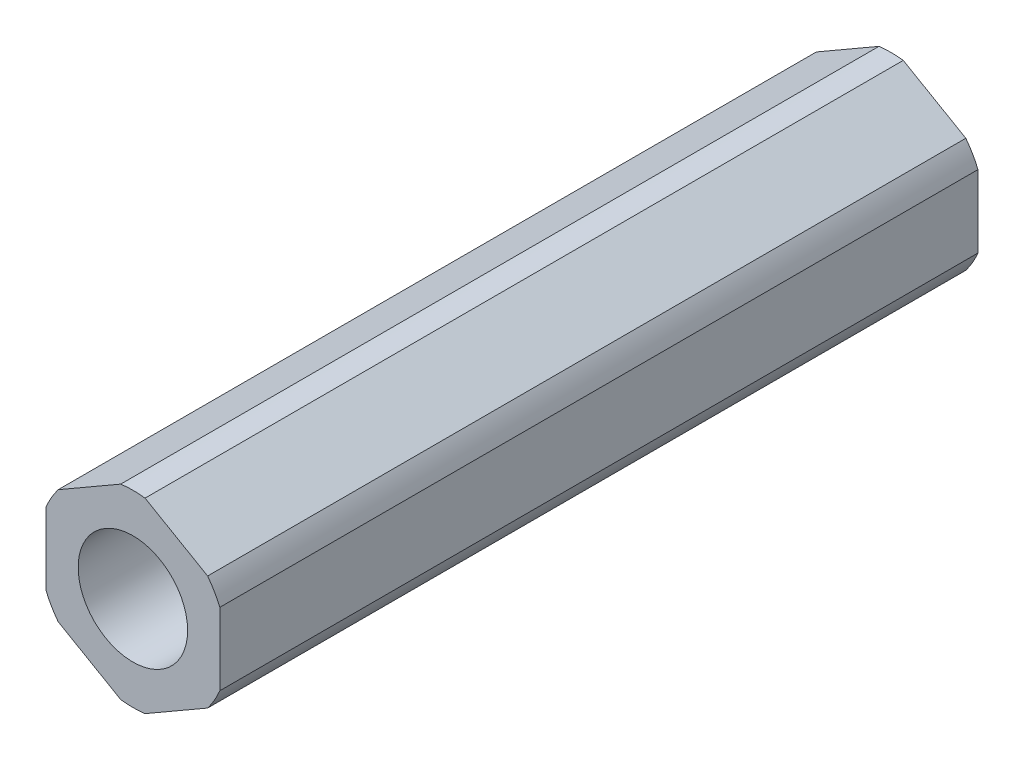
ISO-10303-21;
HEADER;
FILE_DESCRIPTION(('STEP AP214'),'2;1');
FILE_NAME('part.step','',(''),(''),'','','');
FILE_SCHEMA(('AUTOMOTIVE_DESIGN { 1 0 10303 214 1 1 1 1 }'));
ENDSEC;
DATA;
#1=APPLICATION_CONTEXT('core data for automotive mechanical design processes');
#2=APPLICATION_PROTOCOL_DEFINITION('international standard','automotive_design',2000,#1);
#3=PRODUCT_CONTEXT('',#1,'mechanical');
#4=PRODUCT('Part','Part','',(#3));
#5=PRODUCT_RELATED_PRODUCT_CATEGORY('part','',(#4));
#6=PRODUCT_DEFINITION_FORMATION('','',#4);
#7=PRODUCT_DEFINITION_CONTEXT('part definition',#1,'design');
#8=PRODUCT_DEFINITION('design','',#6,#7);
#9=PRODUCT_DEFINITION_SHAPE('','',#8);
#10=(LENGTH_UNIT() NAMED_UNIT(*) SI_UNIT(.MILLI.,.METRE.));
#11=(NAMED_UNIT(*) PLANE_ANGLE_UNIT() SI_UNIT($,.RADIAN.));
#12=(NAMED_UNIT(*) SI_UNIT($,.STERADIAN.) SOLID_ANGLE_UNIT());
#13=UNCERTAINTY_MEASURE_WITH_UNIT(LENGTH_MEASURE(1.E-05),#10,'distance_accuracy_value','');
#14=(GEOMETRIC_REPRESENTATION_CONTEXT(3) GLOBAL_UNCERTAINTY_ASSIGNED_CONTEXT((#13)) GLOBAL_UNIT_ASSIGNED_CONTEXT((#10,
#11,#12)) REPRESENTATION_CONTEXT('',''));
#15=CARTESIAN_POINT('',(0.,0.,0.));
#16=DIRECTION('',(0.,0.,1.));
#17=DIRECTION('',(1.,0.,0.));
#18=AXIS2_PLACEMENT_3D('',#15,#16,#17);
#19=CARTESIAN_POINT('',(0.,0.,27.70251));
#20=DIRECTION('',(0.,0.,1.));
#21=DIRECTION('',(1.,0.,0.));
#22=AXIS2_PLACEMENT_3D('',#19,#20,#21);
#23=PLANE('',#22);
#24=CARTESIAN_POINT('',(0.,0.,27.70251));
#25=DIRECTION('',(0.,0.,1.));
#26=DIRECTION('',(1.,0.,0.));
#27=AXIS2_PLACEMENT_3D('',#24,#25,#26);
#28=CIRCLE('',#27,4.);
#29=CARTESIAN_POINT('',(4.,0.,27.70251));
#30=VERTEX_POINT('',#29);
#31=EDGE_CURVE('E254',#30,#30,#28,.T.);
#32=ORIENTED_EDGE('',*,*,#31,.F.);
#33=EDGE_LOOP('',(#32));
#34=FACE_BOUND('',#33,.T.);
#35=CARTESIAN_POINT('',(0.,0.,27.70251));
#36=DIRECTION('',(0.,0.,1.));
#37=DIRECTION('',(1.,0.,0.));
#38=AXIS2_PLACEMENT_3D('',#35,#36,#37);
#39=CIRCLE('',#38,6.87705);
#40=CARTESIAN_POINT('',(5.46158862213451,-4.17909875751589,27.70251));
#41=VERTEX_POINT('',#40);
#42=CARTESIAN_POINT('',(6.35,-2.64032511303059,27.70251));
#43=VERTEX_POINT('',#42);
#44=EDGE_CURVE('E137',#41,#43,#39,.T.);
#45=ORIENTED_EDGE('',*,*,#44,.T.);
#46=DIRECTION('',(0.,1.,0.));
#47=VECTOR('',#46,1.);
#48=CARTESIAN_POINT('',(6.35,-2.64032511303059,27.70251));
#49=LINE('',#48,#47);
#50=CARTESIAN_POINT('',(6.35,2.64032511303059,27.70251));
#51=VERTEX_POINT('',#50);
#52=EDGE_CURVE('E131',#43,#51,#49,.T.);
#53=ORIENTED_EDGE('',*,*,#52,.T.);
#54=CARTESIAN_POINT('',(0.,0.,27.70251));
#55=DIRECTION('',(0.,0.,1.));
#56=DIRECTION('',(1.,0.,0.));
#57=AXIS2_PLACEMENT_3D('',#54,#55,#56);
#58=CIRCLE('',#57,6.87705);
#59=CARTESIAN_POINT('',(5.46158862213451,4.17909875751589,27.70251));
#60=VERTEX_POINT('',#59);
#61=EDGE_CURVE('E134',#51,#60,#58,.T.);
#62=ORIENTED_EDGE('',*,*,#61,.T.);
#63=DIRECTION('',(-0.866025403784439,0.499999999999999,0.));
#64=VECTOR('',#63,1.);
#65=CARTESIAN_POINT('',(5.46158862213451,4.17909875751589,27.70251));
#66=LINE('',#65,#64);
#67=CARTESIAN_POINT('',(0.888411377865485,6.81942387054648,27.70251));
#68=VERTEX_POINT('',#67);
#69=EDGE_CURVE('E53',#60,#68,#66,.T.);
#70=ORIENTED_EDGE('',*,*,#69,.T.);
#71=CARTESIAN_POINT('',(0.,0.,27.70251));
#72=DIRECTION('',(0.,0.,1.));
#73=DIRECTION('',(1.,0.,0.));
#74=AXIS2_PLACEMENT_3D('',#71,#72,#73);
#75=CIRCLE('',#74,6.87705);
#76=CARTESIAN_POINT('',(-0.88841137786549,6.81942387054648,27.70251));
#77=VERTEX_POINT('',#76);
#78=EDGE_CURVE('E184',#68,#77,#75,.T.);
#79=ORIENTED_EDGE('',*,*,#78,.T.);
#80=DIRECTION('',(-0.866025403784439,-0.5,0.));
#81=VECTOR('',#80,1.);
#82=CARTESIAN_POINT('',(-0.88841137786549,6.81942387054648,27.70251));
#83=LINE('',#82,#81);
#84=CARTESIAN_POINT('',(-5.46158862213451,4.17909875751589,27.70251));
#85=VERTEX_POINT('',#84);
#86=EDGE_CURVE('E106',#77,#85,#83,.T.);
#87=ORIENTED_EDGE('',*,*,#86,.T.);
#88=CARTESIAN_POINT('',(0.,0.,27.70251));
#89=DIRECTION('',(0.,0.,1.));
#90=DIRECTION('',(1.,0.,0.));
#91=AXIS2_PLACEMENT_3D('',#88,#89,#90);
#92=CIRCLE('',#91,6.87705);
#93=CARTESIAN_POINT('',(-6.35,2.64032511303059,27.70251));
#94=VERTEX_POINT('',#93);
#95=EDGE_CURVE('E211',#85,#94,#92,.T.);
#96=ORIENTED_EDGE('',*,*,#95,.T.);
#97=DIRECTION('',(0.,-1.,0.));
#98=VECTOR('',#97,1.);
#99=CARTESIAN_POINT('',(-6.35,2.64032511303059,27.70251));
#100=LINE('',#99,#98);
#101=CARTESIAN_POINT('',(-6.35,-2.64032511303059,27.70251));
#102=VERTEX_POINT('',#101);
#103=EDGE_CURVE('E225',#94,#102,#100,.T.);
#104=ORIENTED_EDGE('',*,*,#103,.T.);
#105=CARTESIAN_POINT('',(0.,0.,27.70251));
#106=DIRECTION('',(0.,0.,1.));
#107=DIRECTION('',(1.,0.,0.));
#108=AXIS2_PLACEMENT_3D('',#105,#106,#107);
#109=CIRCLE('',#108,6.87705);
#110=CARTESIAN_POINT('',(-5.46158862213451,-4.17909875751589,27.70251));
#111=VERTEX_POINT('',#110);
#112=EDGE_CURVE('E222',#102,#111,#109,.T.);
#113=ORIENTED_EDGE('',*,*,#112,.T.);
#114=DIRECTION('',(0.866025403784438,-0.5,0.));
#115=VECTOR('',#114,1.);
#116=CARTESIAN_POINT('',(-5.46158862213451,-4.17909875751589,27.70251));
#117=LINE('',#116,#115);
#118=CARTESIAN_POINT('',(-0.888411377865495,-6.81942387054648,27.70251));
#119=VERTEX_POINT('',#118);
#120=EDGE_CURVE('E224',#111,#119,#117,.T.);
#121=ORIENTED_EDGE('',*,*,#120,.T.);
#122=CARTESIAN_POINT('',(0.,0.,27.70251));
#123=DIRECTION('',(0.,0.,1.));
#124=DIRECTION('',(1.,0.,0.));
#125=AXIS2_PLACEMENT_3D('',#122,#123,#124);
#126=CIRCLE('',#125,6.87705);
#127=CARTESIAN_POINT('',(0.888411377865487,-6.81942387054648,27.70251));
#128=VERTEX_POINT('',#127);
#129=EDGE_CURVE('E227',#119,#128,#126,.T.);
#130=ORIENTED_EDGE('',*,*,#129,.T.);
#131=DIRECTION('',(0.866025403784439,0.5,0.));
#132=VECTOR('',#131,1.);
#133=CARTESIAN_POINT('',(0.88841137786549,-6.81942387054648,27.70251));
#134=LINE('',#133,#132);
#135=EDGE_CURVE('E233',#128,#41,#134,.T.);
#136=ORIENTED_EDGE('',*,*,#135,.T.);
#137=EDGE_LOOP('',(#45,#53,#62,#70,#79,#87,#96,#104,#113,#121,#130,#136));
#138=FACE_BOUND('',#137,.T.);
#139=ADVANCED_FACE('F37',(#34,#138),#23,.T.);
#140=CARTESIAN_POINT('',(-0.88841137786549,6.81942387054648,27.70251));
#141=DIRECTION('',(0.5,-0.866025403784439,0.));
#142=DIRECTION('',(0.866025403784439,0.5,0.));
#143=AXIS2_PLACEMENT_3D('',#140,#141,#142);
#144=PLANE('',#143);
#145=DIRECTION('',(0.,0.,-1.));
#146=VECTOR('',#145,1.);
#147=CARTESIAN_POINT('',(-5.46158862213451,4.17909875751589,27.70251));
#148=LINE('',#147,#146);
#149=CARTESIAN_POINT('',(-5.46158862213451,4.17909875751589,-27.70251));
#150=VERTEX_POINT('',#149);
#151=EDGE_CURVE('E45',#85,#150,#148,.T.);
#152=ORIENTED_EDGE('',*,*,#151,.F.);
#153=ORIENTED_EDGE('',*,*,#86,.F.);
#154=DIRECTION('',(0.,0.,-1.));
#155=VECTOR('',#154,1.);
#156=CARTESIAN_POINT('',(-0.88841137786549,6.81942387054648,27.70251));
#157=LINE('',#156,#155);
#158=CARTESIAN_POINT('',(-0.88841137786549,6.81942387054648,-27.70251));
#159=VERTEX_POINT('',#158);
#160=EDGE_CURVE('E11',#77,#159,#157,.T.);
#161=ORIENTED_EDGE('',*,*,#160,.T.);
#162=DIRECTION('',(-0.866025403784439,-0.5,0.));
#163=VECTOR('',#162,1.);
#164=CARTESIAN_POINT('',(-0.88841137786549,6.81942387054648,-27.70251));
#165=LINE('',#164,#163);
#166=EDGE_CURVE('E159',#159,#150,#165,.T.);
#167=ORIENTED_EDGE('',*,*,#166,.T.);
#168=EDGE_LOOP('',(#152,#153,#161,#167));
#169=FACE_BOUND('',#168,.T.);
#170=ADVANCED_FACE('F261',(#169),#144,.F.);
#171=CARTESIAN_POINT('',(-6.35,2.64032511303059,27.70251));
#172=DIRECTION('',(1.,0.,0.));
#173=DIRECTION('',(0.,0.,-1.));
#174=AXIS2_PLACEMENT_3D('',#171,#172,#173);
#175=PLANE('',#174);
#176=DIRECTION('',(0.,0.,-1.));
#177=VECTOR('',#176,1.);
#178=CARTESIAN_POINT('',(-6.35,-2.64032511303059,27.70251));
#179=LINE('',#178,#177);
#180=CARTESIAN_POINT('',(-6.35,-2.64032511303059,-27.70251));
#181=VERTEX_POINT('',#180);
#182=EDGE_CURVE('E200',#102,#181,#179,.T.);
#183=ORIENTED_EDGE('',*,*,#182,.F.);
#184=ORIENTED_EDGE('',*,*,#103,.F.);
#185=DIRECTION('',(0.,0.,-1.));
#186=VECTOR('',#185,1.);
#187=CARTESIAN_POINT('',(-6.35,2.64032511303059,27.70251));
#188=LINE('',#187,#186);
#189=CARTESIAN_POINT('',(-6.35,2.64032511303059,-27.70251));
#190=VERTEX_POINT('',#189);
#191=EDGE_CURVE('E203',#94,#190,#188,.T.);
#192=ORIENTED_EDGE('',*,*,#191,.T.);
#193=DIRECTION('',(0.,-1.,0.));
#194=VECTOR('',#193,1.);
#195=CARTESIAN_POINT('',(-6.35,2.64032511303059,-27.70251));
#196=LINE('',#195,#194);
#197=EDGE_CURVE('E165',#190,#181,#196,.T.);
#198=ORIENTED_EDGE('',*,*,#197,.T.);
#199=EDGE_LOOP('',(#183,#184,#192,#198));
#200=FACE_BOUND('',#199,.T.);
#201=ADVANCED_FACE('F216',(#200),#175,.F.);
#202=CARTESIAN_POINT('',(-5.46158862213451,-4.17909875751589,27.70251));
#203=DIRECTION('',(0.5,0.866025403784439,0.));
#204=DIRECTION('',(-0.866025403784439,0.5,0.));
#205=AXIS2_PLACEMENT_3D('',#202,#203,#204);
#206=PLANE('',#205);
#207=DIRECTION('',(0.,0.,-1.));
#208=VECTOR('',#207,1.);
#209=CARTESIAN_POINT('',(-0.888411377865495,-6.81942387054648,27.70251));
#210=LINE('',#209,#208);
#211=CARTESIAN_POINT('',(-0.888411377865495,-6.81942387054648,-27.70251));
#212=VERTEX_POINT('',#211);
#213=EDGE_CURVE('E194',#119,#212,#210,.T.);
#214=ORIENTED_EDGE('',*,*,#213,.F.);
#215=ORIENTED_EDGE('',*,*,#120,.F.);
#216=DIRECTION('',(0.,0.,-1.));
#217=VECTOR('',#216,1.);
#218=CARTESIAN_POINT('',(-5.46158862213451,-4.17909875751589,27.70251));
#219=LINE('',#218,#217);
#220=CARTESIAN_POINT('',(-5.46158862213451,-4.17909875751589,-27.70251));
#221=VERTEX_POINT('',#220);
#222=EDGE_CURVE('E197',#111,#221,#219,.T.);
#223=ORIENTED_EDGE('',*,*,#222,.T.);
#224=DIRECTION('',(0.866025403784438,-0.5,0.));
#225=VECTOR('',#224,1.);
#226=CARTESIAN_POINT('',(-5.46158862213451,-4.17909875751589,-27.70251));
#227=LINE('',#226,#225);
#228=EDGE_CURVE('E170',#221,#212,#227,.T.);
#229=ORIENTED_EDGE('',*,*,#228,.T.);
#230=EDGE_LOOP('',(#214,#215,#223,#229));
#231=FACE_BOUND('',#230,.T.);
#232=ADVANCED_FACE('F269',(#231),#206,.F.);
#233=CARTESIAN_POINT('',(0.88841137786549,-6.81942387054648,27.70251));
#234=DIRECTION('',(-0.5,0.866025403784439,0.));
#235=DIRECTION('',(-0.866025403784439,-0.5,0.));
#236=AXIS2_PLACEMENT_3D('',#233,#234,#235);
#237=PLANE('',#236);
#238=DIRECTION('',(0.,0.,-1.));
#239=VECTOR('',#238,1.);
#240=CARTESIAN_POINT('',(5.46158862213451,-4.17909875751589,27.70251));
#241=LINE('',#240,#239);
#242=CARTESIAN_POINT('',(5.46158862213451,-4.17909875751589,-27.70251));
#243=VERTEX_POINT('',#242);
#244=EDGE_CURVE('E188',#41,#243,#241,.T.);
#245=ORIENTED_EDGE('',*,*,#244,.F.);
#246=ORIENTED_EDGE('',*,*,#135,.F.);
#247=DIRECTION('',(0.,0.,-1.));
#248=VECTOR('',#247,1.);
#249=CARTESIAN_POINT('',(0.888411377865487,-6.81942387054648,27.70251));
#250=LINE('',#249,#248);
#251=CARTESIAN_POINT('',(0.888411377865487,-6.81942387054648,-27.70251));
#252=VERTEX_POINT('',#251);
#253=EDGE_CURVE('E191',#128,#252,#250,.T.);
#254=ORIENTED_EDGE('',*,*,#253,.T.);
#255=DIRECTION('',(0.866025403784439,0.5,0.));
#256=VECTOR('',#255,1.);
#257=CARTESIAN_POINT('',(0.88841137786549,-6.81942387054648,-27.70251));
#258=LINE('',#257,#256);
#259=EDGE_CURVE('E175',#252,#243,#258,.T.);
#260=ORIENTED_EDGE('',*,*,#259,.T.);
#261=EDGE_LOOP('',(#245,#246,#254,#260));
#262=FACE_BOUND('',#261,.T.);
#263=ADVANCED_FACE('F239',(#262),#237,.F.);
#264=CARTESIAN_POINT('',(6.35,-2.64032511303059,27.70251));
#265=DIRECTION('',(-1.,0.,0.));
#266=DIRECTION('',(0.,0.,1.));
#267=AXIS2_PLACEMENT_3D('',#264,#265,#266);
#268=PLANE('',#267);
#269=ORIENTED_EDGE('',*,*,#52,.F.);
#270=DIRECTION('',(0.,0.,-1.));
#271=VECTOR('',#270,1.);
#272=CARTESIAN_POINT('',(6.35,-2.64032511303059,27.70251));
#273=LINE('',#272,#271);
#274=CARTESIAN_POINT('',(6.35,-2.64032511303059,-27.70251));
#275=VERTEX_POINT('',#274);
#276=EDGE_CURVE('E147',#43,#275,#273,.T.);
#277=ORIENTED_EDGE('',*,*,#276,.T.);
#278=DIRECTION('',(0.,1.,0.));
#279=VECTOR('',#278,1.);
#280=CARTESIAN_POINT('',(6.35,-2.64032511303059,-27.70251));
#281=LINE('',#280,#279);
#282=CARTESIAN_POINT('',(6.35,2.64032511303059,-27.70251));
#283=VERTEX_POINT('',#282);
#284=EDGE_CURVE('E145',#275,#283,#281,.T.);
#285=ORIENTED_EDGE('',*,*,#284,.T.);
#286=DIRECTION('',(0.,0.,-1.));
#287=VECTOR('',#286,1.);
#288=CARTESIAN_POINT('',(6.35,2.64032511303059,27.70251));
#289=LINE('',#288,#287);
#290=EDGE_CURVE('E143',#51,#283,#289,.T.);
#291=ORIENTED_EDGE('',*,*,#290,.F.);
#292=EDGE_LOOP('',(#269,#277,#285,#291));
#293=FACE_BOUND('',#292,.T.);
#294=ADVANCED_FACE('F144',(#293),#268,.F.);
#295=CARTESIAN_POINT('',(5.46158862213451,4.17909875751589,27.70251));
#296=DIRECTION('',(-0.499999999999999,-0.866025403784439,0.));
#297=DIRECTION('',(0.866025403784439,-0.499999999999999,0.));
#298=AXIS2_PLACEMENT_3D('',#295,#296,#297);
#299=PLANE('',#298);
#300=DIRECTION('',(0.,0.,-1.));
#301=VECTOR('',#300,1.);
#302=CARTESIAN_POINT('',(0.888411377865485,6.81942387054648,27.70251));
#303=LINE('',#302,#301);
#304=CARTESIAN_POINT('',(0.888411377865485,6.81942387054648,-27.70251));
#305=VERTEX_POINT('',#304);
#306=EDGE_CURVE('E152',#68,#305,#303,.T.);
#307=ORIENTED_EDGE('',*,*,#306,.F.);
#308=ORIENTED_EDGE('',*,*,#69,.F.);
#309=DIRECTION('',(0.,0.,-1.));
#310=VECTOR('',#309,1.);
#311=CARTESIAN_POINT('',(5.46158862213451,4.17909875751589,27.70251));
#312=LINE('',#311,#310);
#313=CARTESIAN_POINT('',(5.46158862213451,4.17909875751589,-27.70251));
#314=VERTEX_POINT('',#313);
#315=EDGE_CURVE('E148',#60,#314,#312,.T.);
#316=ORIENTED_EDGE('',*,*,#315,.T.);
#317=DIRECTION('',(-0.866025403784439,0.499999999999999,0.));
#318=VECTOR('',#317,1.);
#319=CARTESIAN_POINT('',(5.46158862213451,4.17909875751589,-27.70251));
#320=LINE('',#319,#318);
#321=EDGE_CURVE('E94',#314,#305,#320,.T.);
#322=ORIENTED_EDGE('',*,*,#321,.T.);
#323=EDGE_LOOP('',(#307,#308,#316,#322));
#324=FACE_BOUND('',#323,.T.);
#325=ADVANCED_FACE('F244',(#324),#299,.F.);
#326=CARTESIAN_POINT('',(0.,0.,27.70251));
#327=DIRECTION('',(0.,0.,-1.));
#328=DIRECTION('',(-1.,0.,0.));
#329=AXIS2_PLACEMENT_3D('',#326,#327,#328);
#330=CYLINDRICAL_SURFACE('',#329,6.87705);
#331=CARTESIAN_POINT('',(0.,0.,-27.70251));
#332=DIRECTION('',(0.,0.,1.));
#333=DIRECTION('',(1.,0.,0.));
#334=AXIS2_PLACEMENT_3D('',#331,#332,#333);
#335=CIRCLE('',#334,6.87705);
#336=EDGE_CURVE('E156',#305,#159,#335,.T.);
#337=ORIENTED_EDGE('',*,*,#336,.T.);
#338=ORIENTED_EDGE('',*,*,#160,.F.);
#339=ORIENTED_EDGE('',*,*,#78,.F.);
#340=ORIENTED_EDGE('',*,*,#306,.T.);
#341=EDGE_LOOP('',(#337,#338,#339,#340));
#342=FACE_BOUND('',#341,.T.);
#343=ADVANCED_FACE('F248',(#342),#330,.T.);
#344=CARTESIAN_POINT('',(0.,0.,27.70251));
#345=DIRECTION('',(0.,0.,-1.));
#346=DIRECTION('',(-1.,0.,0.));
#347=AXIS2_PLACEMENT_3D('',#344,#345,#346);
#348=CYLINDRICAL_SURFACE('',#347,6.87705);
#349=CARTESIAN_POINT('',(0.,0.,-27.70251));
#350=DIRECTION('',(0.,0.,1.));
#351=DIRECTION('',(1.,0.,0.));
#352=AXIS2_PLACEMENT_3D('',#349,#350,#351);
#353=CIRCLE('',#352,6.87705);
#354=EDGE_CURVE('E162',#150,#190,#353,.T.);
#355=ORIENTED_EDGE('',*,*,#354,.T.);
#356=ORIENTED_EDGE('',*,*,#191,.F.);
#357=ORIENTED_EDGE('',*,*,#95,.F.);
#358=ORIENTED_EDGE('',*,*,#151,.T.);
#359=EDGE_LOOP('',(#355,#356,#357,#358));
#360=FACE_BOUND('',#359,.T.);
#361=ADVANCED_FACE('F209',(#360),#348,.T.);
#362=CARTESIAN_POINT('',(0.,0.,27.70251));
#363=DIRECTION('',(0.,0.,-1.));
#364=DIRECTION('',(-1.,0.,0.));
#365=AXIS2_PLACEMENT_3D('',#362,#363,#364);
#366=CYLINDRICAL_SURFACE('',#365,6.87705);
#367=CARTESIAN_POINT('',(0.,0.,-27.70251));
#368=DIRECTION('',(0.,0.,1.));
#369=DIRECTION('',(1.,0.,0.));
#370=AXIS2_PLACEMENT_3D('',#367,#368,#369);
#371=CIRCLE('',#370,6.87705);
#372=EDGE_CURVE('E167',#181,#221,#371,.T.);
#373=ORIENTED_EDGE('',*,*,#372,.T.);
#374=ORIENTED_EDGE('',*,*,#222,.F.);
#375=ORIENTED_EDGE('',*,*,#112,.F.);
#376=ORIENTED_EDGE('',*,*,#182,.T.);
#377=EDGE_LOOP('',(#373,#374,#375,#376));
#378=FACE_BOUND('',#377,.T.);
#379=ADVANCED_FACE('F220',(#378),#366,.T.);
#380=CARTESIAN_POINT('',(0.,0.,27.70251));
#381=DIRECTION('',(0.,0.,-1.));
#382=DIRECTION('',(-1.,0.,0.));
#383=AXIS2_PLACEMENT_3D('',#380,#381,#382);
#384=CYLINDRICAL_SURFACE('',#383,6.87705);
#385=CARTESIAN_POINT('',(0.,0.,-27.70251));
#386=DIRECTION('',(0.,0.,1.));
#387=DIRECTION('',(1.,0.,0.));
#388=AXIS2_PLACEMENT_3D('',#385,#386,#387);
#389=CIRCLE('',#388,6.87705);
#390=EDGE_CURVE('E172',#212,#252,#389,.T.);
#391=ORIENTED_EDGE('',*,*,#390,.T.);
#392=ORIENTED_EDGE('',*,*,#253,.F.);
#393=ORIENTED_EDGE('',*,*,#129,.F.);
#394=ORIENTED_EDGE('',*,*,#213,.T.);
#395=EDGE_LOOP('',(#391,#392,#393,#394));
#396=FACE_BOUND('',#395,.T.);
#397=ADVANCED_FACE('F287',(#396),#384,.T.);
#398=CARTESIAN_POINT('',(0.,0.,27.70251));
#399=DIRECTION('',(0.,0.,-1.));
#400=DIRECTION('',(-1.,0.,0.));
#401=AXIS2_PLACEMENT_3D('',#398,#399,#400);
#402=CYLINDRICAL_SURFACE('',#401,6.87705);
#403=CARTESIAN_POINT('',(0.,0.,-27.70251));
#404=DIRECTION('',(0.,0.,1.));
#405=DIRECTION('',(1.,0.,0.));
#406=AXIS2_PLACEMENT_3D('',#403,#404,#405);
#407=CIRCLE('',#406,6.87705);
#408=EDGE_CURVE('E177',#243,#275,#407,.T.);
#409=ORIENTED_EDGE('',*,*,#408,.T.);
#410=ORIENTED_EDGE('',*,*,#276,.F.);
#411=ORIENTED_EDGE('',*,*,#44,.F.);
#412=ORIENTED_EDGE('',*,*,#244,.T.);
#413=EDGE_LOOP('',(#409,#410,#411,#412));
#414=FACE_BOUND('',#413,.T.);
#415=ADVANCED_FACE('F242',(#414),#402,.T.);
#416=CARTESIAN_POINT('',(0.,0.,27.70251));
#417=DIRECTION('',(0.,0.,-1.));
#418=DIRECTION('',(-1.,0.,0.));
#419=AXIS2_PLACEMENT_3D('',#416,#417,#418);
#420=CYLINDRICAL_SURFACE('',#419,6.87705);
#421=CARTESIAN_POINT('',(0.,0.,-27.70251));
#422=DIRECTION('',(0.,0.,1.));
#423=DIRECTION('',(1.,0.,0.));
#424=AXIS2_PLACEMENT_3D('',#421,#422,#423);
#425=CIRCLE('',#424,6.87705);
#426=EDGE_CURVE('E181',#283,#314,#425,.T.);
#427=ORIENTED_EDGE('',*,*,#426,.T.);
#428=ORIENTED_EDGE('',*,*,#315,.F.);
#429=ORIENTED_EDGE('',*,*,#61,.F.);
#430=ORIENTED_EDGE('',*,*,#290,.T.);
#431=EDGE_LOOP('',(#427,#428,#429,#430));
#432=FACE_BOUND('',#431,.T.);
#433=ADVANCED_FACE('F150',(#432),#420,.T.);
#434=CARTESIAN_POINT('',(0.,0.,-27.70251));
#435=DIRECTION('',(0.,0.,1.));
#436=DIRECTION('',(1.,0.,0.));
#437=AXIS2_PLACEMENT_3D('',#434,#435,#436);
#438=PLANE('',#437);
#439=CARTESIAN_POINT('',(0.,0.,-27.70251));
#440=DIRECTION('',(0.,0.,1.));
#441=DIRECTION('',(1.,0.,0.));
#442=AXIS2_PLACEMENT_3D('',#439,#440,#441);
#443=CIRCLE('',#442,4.);
#444=CARTESIAN_POINT('',(4.,0.,-27.70251));
#445=VERTEX_POINT('',#444);
#446=EDGE_CURVE('E160',#445,#445,#443,.T.);
#447=ORIENTED_EDGE('',*,*,#446,.T.);
#448=EDGE_LOOP('',(#447));
#449=FACE_BOUND('',#448,.T.);
#450=ORIENTED_EDGE('',*,*,#321,.F.);
#451=ORIENTED_EDGE('',*,*,#426,.F.);
#452=ORIENTED_EDGE('',*,*,#284,.F.);
#453=ORIENTED_EDGE('',*,*,#408,.F.);
#454=ORIENTED_EDGE('',*,*,#259,.F.);
#455=ORIENTED_EDGE('',*,*,#390,.F.);
#456=ORIENTED_EDGE('',*,*,#228,.F.);
#457=ORIENTED_EDGE('',*,*,#372,.F.);
#458=ORIENTED_EDGE('',*,*,#197,.F.);
#459=ORIENTED_EDGE('',*,*,#354,.F.);
#460=ORIENTED_EDGE('',*,*,#166,.F.);
#461=ORIENTED_EDGE('',*,*,#336,.F.);
#462=EDGE_LOOP('',(#450,#451,#452,#453,#454,#455,#456,#457,#458,#459,#460,#461));
#463=FACE_BOUND('',#462,.T.);
#464=ADVANCED_FACE('F212',(#449,#463),#438,.F.);
#465=CARTESIAN_POINT('',(0.,0.,-27.70251));
#466=DIRECTION('',(0.,0.,1.));
#467=DIRECTION('',(1.,0.,0.));
#468=AXIS2_PLACEMENT_3D('',#465,#466,#467);
#469=CYLINDRICAL_SURFACE('',#468,4.);
#470=ORIENTED_EDGE('',*,*,#446,.F.);
#471=EDGE_LOOP('',(#470));
#472=FACE_BOUND('',#471,.T.);
#473=ORIENTED_EDGE('',*,*,#31,.T.);
#474=EDGE_LOOP('',(#473));
#475=FACE_BOUND('',#474,.T.);
#476=ADVANCED_FACE('F258',(#472,#475),#469,.F.);
#477=CLOSED_SHELL('',(#139,#170,#201,#232,#263,#294,#325,#343,#361,#379,#397,#415,#433,#464,#476));
#478=MANIFOLD_SOLID_BREP('B2',#477);
#479=ADVANCED_BREP_SHAPE_REPRESENTATION('',(#18,#478),#14);
#480=SHAPE_DEFINITION_REPRESENTATION(#9,#479);
ENDSEC;
END-ISO-10303-21;
